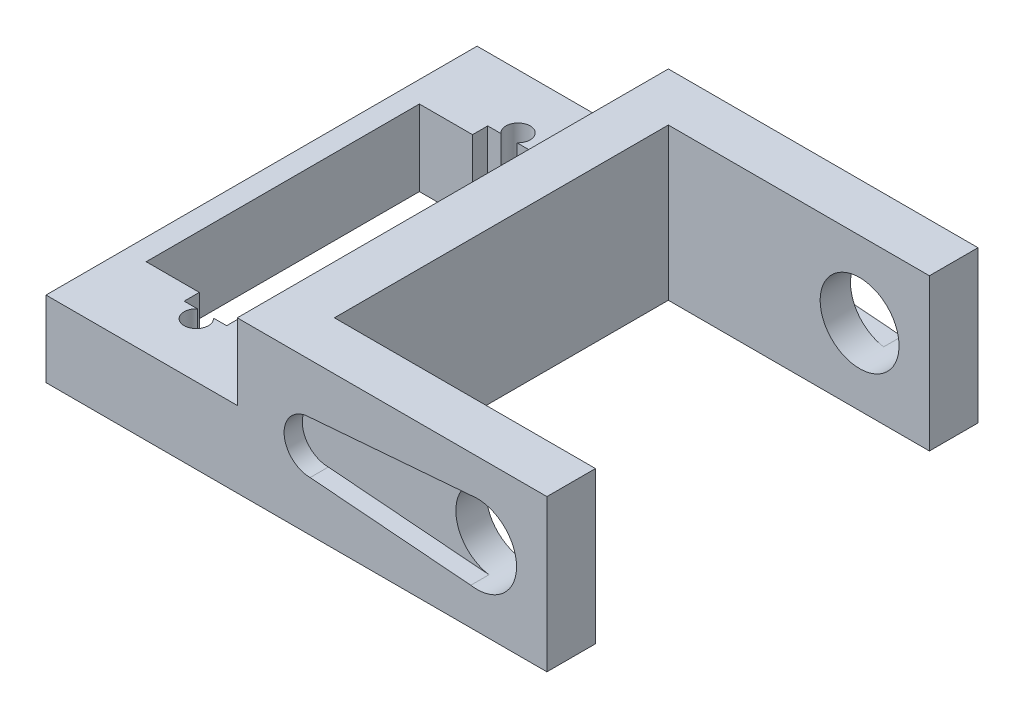
ISO-10303-21;
HEADER;
FILE_DESCRIPTION(('STEP AP214'),'2;1');
FILE_NAME('part.step','',(''),(''),'','','');
FILE_SCHEMA(('AUTOMOTIVE_DESIGN { 1 0 10303 214 1 1 1 1 }'));
ENDSEC;
DATA;
#1=APPLICATION_CONTEXT('core data for automotive mechanical design processes');
#2=APPLICATION_PROTOCOL_DEFINITION('international standard','automotive_design',2000,#1);
#3=PRODUCT_CONTEXT('',#1,'mechanical');
#4=PRODUCT('Part','Part','',(#3));
#5=PRODUCT_RELATED_PRODUCT_CATEGORY('part','',(#4));
#6=PRODUCT_DEFINITION_FORMATION('','',#4);
#7=PRODUCT_DEFINITION_CONTEXT('part definition',#1,'design');
#8=PRODUCT_DEFINITION('design','',#6,#7);
#9=PRODUCT_DEFINITION_SHAPE('','',#8);
#10=(LENGTH_UNIT() NAMED_UNIT(*) SI_UNIT(.MILLI.,.METRE.));
#11=(NAMED_UNIT(*) PLANE_ANGLE_UNIT() SI_UNIT($,.RADIAN.));
#12=(NAMED_UNIT(*) SI_UNIT($,.STERADIAN.) SOLID_ANGLE_UNIT());
#13=UNCERTAINTY_MEASURE_WITH_UNIT(LENGTH_MEASURE(1.E-05),#10,'distance_accuracy_value','');
#14=(GEOMETRIC_REPRESENTATION_CONTEXT(3) GLOBAL_UNCERTAINTY_ASSIGNED_CONTEXT((#13)) GLOBAL_UNIT_ASSIGNED_CONTEXT((#10,
#11,#12)) REPRESENTATION_CONTEXT('',''));
#15=CARTESIAN_POINT('',(0.,0.,0.));
#16=DIRECTION('',(0.,0.,1.));
#17=DIRECTION('',(1.,0.,0.));
#18=AXIS2_PLACEMENT_3D('',#15,#16,#17);
#19=CARTESIAN_POINT('',(-20.955,12.7,18.034));
#20=DIRECTION('',(0.,0.,-1.));
#21=DIRECTION('',(-1.,0.,0.));
#22=AXIS2_PLACEMENT_3D('',#19,#20,#21);
#23=PLANE('',#22);
#24=DIRECTION('',(1.,0.,0.));
#25=VECTOR('',#24,1.);
#26=CARTESIAN_POINT('',(-20.955,12.7,18.034));
#27=LINE('',#26,#25);
#28=CARTESIAN_POINT('',(-4.953,12.7,18.034));
#29=VERTEX_POINT('',#28);
#30=CARTESIAN_POINT('',(20.955,12.7,18.034));
#31=VERTEX_POINT('',#30);
#32=EDGE_CURVE('E496',#29,#31,#27,.T.);
#33=ORIENTED_EDGE('',*,*,#32,.F.);
#34=DIRECTION('',(0.,1.,0.));
#35=VECTOR('',#34,1.);
#36=CARTESIAN_POINT('',(-4.953,6.35,18.034));
#37=LINE('',#36,#35);
#38=CARTESIAN_POINT('',(-4.953,6.35,18.034));
#39=VERTEX_POINT('',#38);
#40=EDGE_CURVE('E456',#39,#29,#37,.T.);
#41=ORIENTED_EDGE('',*,*,#40,.F.);
#42=DIRECTION('',(1.,0.,0.));
#43=VECTOR('',#42,1.);
#44=CARTESIAN_POINT('',(-20.955,6.35,18.034));
#45=LINE('',#44,#43);
#46=CARTESIAN_POINT('',(-20.955,6.35,18.034));
#47=VERTEX_POINT('',#46);
#48=EDGE_CURVE('E448',#47,#39,#45,.T.);
#49=ORIENTED_EDGE('',*,*,#48,.F.);
#50=DIRECTION('',(0.,-1.,0.));
#51=VECTOR('',#50,1.);
#52=CARTESIAN_POINT('',(-20.955,12.7,18.034));
#53=LINE('',#52,#51);
#54=CARTESIAN_POINT('',(-20.955,0.,18.034));
#55=VERTEX_POINT('',#54);
#56=EDGE_CURVE('E512',#47,#55,#53,.T.);
#57=ORIENTED_EDGE('',*,*,#56,.T.);
#58=DIRECTION('',(1.,0.,0.));
#59=VECTOR('',#58,1.);
#60=CARTESIAN_POINT('',(-20.955,0.,18.034));
#61=LINE('',#60,#59);
#62=CARTESIAN_POINT('',(20.955,0.,18.034));
#63=VERTEX_POINT('',#62);
#64=EDGE_CURVE('E508',#55,#63,#61,.T.);
#65=ORIENTED_EDGE('',*,*,#64,.T.);
#66=DIRECTION('',(0.,-1.,0.));
#67=VECTOR('',#66,1.);
#68=CARTESIAN_POINT('',(20.955,12.7,18.034));
#69=LINE('',#68,#67);
#70=EDGE_CURVE('E498',#31,#63,#69,.T.);
#71=ORIENTED_EDGE('',*,*,#70,.F.);
#72=EDGE_LOOP('',(#33,#41,#49,#57,#65,#71));
#73=FACE_BOUND('',#72,.T.);
#74=DIRECTION('',(0.996775462939374,0.0802413639091295,0.));
#75=VECTOR('',#74,1.);
#76=CARTESIAN_POINT('',(-0.674684556216888,8.38107651837434,18.034));
#77=LINE('',#76,#75);
#78=CARTESIAN_POINT('',(1.14299999999999,8.52740183773693,18.034));
#79=VERTEX_POINT('',#78);
#80=CARTESIAN_POINT('',(14.5847947599705,9.60947898051289,18.034));
#81=VERTEX_POINT('',#80);
#82=EDGE_CURVE('E295',#79,#81,#77,.T.);
#83=ORIENTED_EDGE('',*,*,#82,.T.);
#84=CARTESIAN_POINT('',(15.113,6.35,18.034));
#85=DIRECTION('',(0.,0.,-1.));
#86=DIRECTION('',(-1.,0.,0.));
#87=AXIS2_PLACEMENT_3D('',#84,#85,#86);
#88=CIRCLE('',#87,3.302);
#89=CARTESIAN_POINT('',(14.5847947599705,3.09052101948711,18.034));
#90=VERTEX_POINT('',#89);
#91=EDGE_CURVE('E283',#81,#90,#88,.T.);
#92=ORIENTED_EDGE('',*,*,#91,.T.);
#93=DIRECTION('',(0.996775462939374,-0.0802413639091295,0.));
#94=VECTOR('',#93,1.);
#95=CARTESIAN_POINT('',(0.34109475153221,4.2371522903043,18.034));
#96=LINE('',#95,#94);
#97=CARTESIAN_POINT('',(1.14299999999999,4.17259816226307,18.034));
#98=VERTEX_POINT('',#97);
#99=EDGE_CURVE('E296',#98,#90,#96,.T.);
#100=ORIENTED_EDGE('',*,*,#99,.F.);
#101=CARTESIAN_POINT('',(1.14299999999999,6.35,18.034));
#102=DIRECTION('',(0.,0.,-1.));
#103=DIRECTION('',(-1.,0.,0.));
#104=AXIS2_PLACEMENT_3D('',#101,#102,#103);
#105=CIRCLE('',#104,2.17740183773693);
#106=EDGE_CURVE('E86',#98,#79,#105,.T.);
#107=ORIENTED_EDGE('',*,*,#106,.T.);
#108=EDGE_LOOP('',(#83,#92,#100,#107));
#109=FACE_BOUND('',#108,.T.);
#110=ADVANCED_FACE('F63',(#73,#109),#23,.F.);
#111=CARTESIAN_POINT('',(0.,0.,0.));
#112=DIRECTION('',(0.,1.,0.));
#113=DIRECTION('',(0.,0.,1.));
#114=AXIS2_PLACEMENT_3D('',#111,#112,#113);
#115=PLANE('',#114);
#116=DIRECTION('',(0.,0.,1.));
#117=VECTOR('',#116,1.);
#118=CARTESIAN_POINT('',(-0.888999999999997,0.,-13.97));
#119=LINE('',#118,#117);
#120=CARTESIAN_POINT('',(-0.888999999999997,0.,-13.97));
#121=VERTEX_POINT('',#120);
#122=CARTESIAN_POINT('',(-0.888999999999994,0.,13.97));
#123=VERTEX_POINT('',#122);
#124=EDGE_CURVE('E466',#121,#123,#119,.T.);
#125=ORIENTED_EDGE('',*,*,#124,.T.);
#126=DIRECTION('',(1.,0.,0.));
#127=VECTOR('',#126,1.);
#128=CARTESIAN_POINT('',(20.955,0.,13.97));
#129=LINE('',#128,#127);
#130=CARTESIAN_POINT('',(20.955,0.,13.97));
#131=VERTEX_POINT('',#130);
#132=EDGE_CURVE('E470',#123,#131,#129,.T.);
#133=ORIENTED_EDGE('',*,*,#132,.T.);
#134=DIRECTION('',(0.,0.,-1.));
#135=VECTOR('',#134,1.);
#136=CARTESIAN_POINT('',(20.955,0.,-18.034));
#137=LINE('',#136,#135);
#138=EDGE_CURVE('E499',#63,#131,#137,.T.);
#139=ORIENTED_EDGE('',*,*,#138,.F.);
#140=ORIENTED_EDGE('',*,*,#64,.F.);
#141=DIRECTION('',(0.,0.,1.));
#142=VECTOR('',#141,1.);
#143=CARTESIAN_POINT('',(-20.955,0.,-18.034));
#144=LINE('',#143,#142);
#145=CARTESIAN_POINT('',(-20.955,0.,-18.034));
#146=VERTEX_POINT('',#145);
#147=EDGE_CURVE('E505',#146,#55,#144,.T.);
#148=ORIENTED_EDGE('',*,*,#147,.F.);
#149=DIRECTION('',(-1.,0.,0.));
#150=VECTOR('',#149,1.);
#151=CARTESIAN_POINT('',(-20.955,0.,-18.034));
#152=LINE('',#151,#150);
#153=CARTESIAN_POINT('',(20.955,0.,-18.034));
#154=VERTEX_POINT('',#153);
#155=EDGE_CURVE('E502',#154,#146,#152,.T.);
#156=ORIENTED_EDGE('',*,*,#155,.F.);
#157=CARTESIAN_POINT('',(20.955,0.,-13.97));
#158=VERTEX_POINT('',#157);
#159=EDGE_CURVE('E483',#158,#154,#137,.T.);
#160=ORIENTED_EDGE('',*,*,#159,.F.);
#161=DIRECTION('',(-1.,0.,0.));
#162=VECTOR('',#161,1.);
#163=CARTESIAN_POINT('',(20.955,0.,-13.97));
#164=LINE('',#163,#162);
#165=EDGE_CURVE('E463',#158,#121,#164,.T.);
#166=ORIENTED_EDGE('',*,*,#165,.T.);
#167=EDGE_LOOP('',(#125,#133,#139,#140,#148,#156,#160,#166));
#168=FACE_BOUND('',#167,.T.);
#169=DIRECTION('',(0.,0.,-1.));
#170=VECTOR('',#169,1.);
#171=CARTESIAN_POINT('',(-14.732,0.,-10.16));
#172=LINE('',#171,#170);
#173=CARTESIAN_POINT('',(-14.732,0.,-11.43));
#174=VERTEX_POINT('',#173);
#175=CARTESIAN_POINT('',(-14.732,0.,-12.7));
#176=VERTEX_POINT('',#175);
#177=EDGE_CURVE('E356',#174,#176,#172,.T.);
#178=ORIENTED_EDGE('',*,*,#177,.F.);
#179=DIRECTION('',(-1.,0.,0.));
#180=VECTOR('',#179,1.);
#181=CARTESIAN_POINT('',(-6.731,0.,-11.43));
#182=LINE('',#181,#180);
#183=CARTESIAN_POINT('',(-19.177,0.,-11.43));
#184=VERTEX_POINT('',#183);
#185=EDGE_CURVE('E419',#174,#184,#182,.T.);
#186=ORIENTED_EDGE('',*,*,#185,.T.);
#187=DIRECTION('',(0.,0.,1.));
#188=VECTOR('',#187,1.);
#189=CARTESIAN_POINT('',(-19.177,0.,-11.43));
#190=LINE('',#189,#188);
#191=CARTESIAN_POINT('',(-19.177,0.,11.43));
#192=VERTEX_POINT('',#191);
#193=EDGE_CURVE('E408',#184,#192,#190,.T.);
#194=ORIENTED_EDGE('',*,*,#193,.T.);
#195=DIRECTION('',(1.,0.,0.));
#196=VECTOR('',#195,1.);
#197=CARTESIAN_POINT('',(-6.731,0.,11.43));
#198=LINE('',#197,#196);
#199=CARTESIAN_POINT('',(-14.732,0.,11.43));
#200=VERTEX_POINT('',#199);
#201=EDGE_CURVE('E413',#192,#200,#198,.T.);
#202=ORIENTED_EDGE('',*,*,#201,.T.);
#203=DIRECTION('',(0.,0.,1.));
#204=VECTOR('',#203,1.);
#205=CARTESIAN_POINT('',(-14.732,0.,10.16));
#206=LINE('',#205,#204);
#207=CARTESIAN_POINT('',(-14.732,0.,12.7));
#208=VERTEX_POINT('',#207);
#209=EDGE_CURVE('E375',#200,#208,#206,.T.);
#210=ORIENTED_EDGE('',*,*,#209,.T.);
#211=DIRECTION('',(-1.,0.,0.));
#212=VECTOR('',#211,1.);
#213=CARTESIAN_POINT('',(-11.176,0.,12.7));
#214=LINE('',#213,#212);
#215=CARTESIAN_POINT('',(-13.6260208330104,0.,12.7));
#216=VERTEX_POINT('',#215);
#217=EDGE_CURVE('E378',#216,#208,#214,.T.);
#218=ORIENTED_EDGE('',*,*,#217,.F.);
#219=CARTESIAN_POINT('',(-12.954,0.,13.462));
#220=DIRECTION('',(0.,1.,0.));
#221=DIRECTION('',(0.,0.,1.));
#222=AXIS2_PLACEMENT_3D('',#219,#220,#221);
#223=CIRCLE('',#222,1.016);
#224=CARTESIAN_POINT('',(-12.2819791669896,0.,12.7));
#225=VERTEX_POINT('',#224);
#226=EDGE_CURVE('E389',#216,#225,#223,.T.);
#227=ORIENTED_EDGE('',*,*,#226,.T.);
#228=CARTESIAN_POINT('',(-11.176,0.,12.7));
#229=VERTEX_POINT('',#228);
#230=EDGE_CURVE('E380',#229,#225,#214,.T.);
#231=ORIENTED_EDGE('',*,*,#230,.F.);
#232=DIRECTION('',(0.,0.,1.));
#233=VECTOR('',#232,1.);
#234=CARTESIAN_POINT('',(-11.176,0.,10.16));
#235=LINE('',#234,#233);
#236=CARTESIAN_POINT('',(-11.176,0.,11.43));
#237=VERTEX_POINT('',#236);
#238=EDGE_CURVE('E383',#237,#229,#235,.T.);
#239=ORIENTED_EDGE('',*,*,#238,.F.);
#240=CARTESIAN_POINT('',(-6.731,0.,11.43));
#241=VERTEX_POINT('',#240);
#242=EDGE_CURVE('E411',#237,#241,#198,.T.);
#243=ORIENTED_EDGE('',*,*,#242,.T.);
#244=DIRECTION('',(0.,0.,-1.));
#245=VECTOR('',#244,1.);
#246=CARTESIAN_POINT('',(-6.731,0.,-11.43));
#247=LINE('',#246,#245);
#248=CARTESIAN_POINT('',(-6.731,0.,-11.43));
#249=VERTEX_POINT('',#248);
#250=EDGE_CURVE('E416',#241,#249,#247,.T.);
#251=ORIENTED_EDGE('',*,*,#250,.T.);
#252=CARTESIAN_POINT('',(-11.176,0.,-11.43));
#253=VERTEX_POINT('',#252);
#254=EDGE_CURVE('E420',#249,#253,#182,.T.);
#255=ORIENTED_EDGE('',*,*,#254,.T.);
#256=DIRECTION('',(0.,0.,-1.));
#257=VECTOR('',#256,1.);
#258=CARTESIAN_POINT('',(-11.176,0.,-10.16));
#259=LINE('',#258,#257);
#260=CARTESIAN_POINT('',(-11.176,0.,-12.7));
#261=VERTEX_POINT('',#260);
#262=EDGE_CURVE('E352',#253,#261,#259,.T.);
#263=ORIENTED_EDGE('',*,*,#262,.T.);
#264=DIRECTION('',(-1.,0.,0.));
#265=VECTOR('',#264,1.);
#266=CARTESIAN_POINT('',(-11.176,0.,-12.7));
#267=LINE('',#266,#265);
#268=CARTESIAN_POINT('',(-12.2819791669896,0.,-12.7));
#269=VERTEX_POINT('',#268);
#270=EDGE_CURVE('E366',#261,#269,#267,.T.);
#271=ORIENTED_EDGE('',*,*,#270,.T.);
#272=CARTESIAN_POINT('',(-12.954,0.,-13.462));
#273=DIRECTION('',(0.,-1.,0.));
#274=DIRECTION('',(0.,0.,-1.));
#275=AXIS2_PLACEMENT_3D('',#272,#273,#274);
#276=CIRCLE('',#275,1.016);
#277=CARTESIAN_POINT('',(-13.6260208330104,0.,-12.7));
#278=VERTEX_POINT('',#277);
#279=EDGE_CURVE('E344',#278,#269,#276,.T.);
#280=ORIENTED_EDGE('',*,*,#279,.F.);
#281=EDGE_CURVE('E369',#278,#176,#267,.T.);
#282=ORIENTED_EDGE('',*,*,#281,.T.);
#283=EDGE_LOOP('',(#178,#186,#194,#202,#210,#218,#227,#231,#239,#243,#251,#255,#263,#271,#280,#282));
#284=FACE_BOUND('',#283,.T.);
#285=ADVANCED_FACE('F534',(#168,#284),#115,.F.);
#286=CARTESIAN_POINT('',(0.,6.35,0.));
#287=DIRECTION('',(0.,-1.,0.));
#288=DIRECTION('',(0.,0.,-1.));
#289=AXIS2_PLACEMENT_3D('',#286,#287,#288);
#290=PLANE('',#289);
#291=DIRECTION('',(0.,0.,1.));
#292=VECTOR('',#291,1.);
#293=CARTESIAN_POINT('',(-20.955,6.35,18.034));
#294=LINE('',#293,#292);
#295=CARTESIAN_POINT('',(-20.955,6.35,-18.034));
#296=VERTEX_POINT('',#295);
#297=EDGE_CURVE('E446',#296,#47,#294,.T.);
#298=ORIENTED_EDGE('',*,*,#297,.T.);
#299=ORIENTED_EDGE('',*,*,#48,.T.);
#300=DIRECTION('',(0.,0.,-1.));
#301=VECTOR('',#300,1.);
#302=CARTESIAN_POINT('',(-4.953,6.35,18.034));
#303=LINE('',#302,#301);
#304=CARTESIAN_POINT('',(-4.953,6.35,-18.034));
#305=VERTEX_POINT('',#304);
#306=EDGE_CURVE('E451',#39,#305,#303,.T.);
#307=ORIENTED_EDGE('',*,*,#306,.T.);
#308=DIRECTION('',(-1.,0.,0.));
#309=VECTOR('',#308,1.);
#310=CARTESIAN_POINT('',(-20.955,6.35,-18.034));
#311=LINE('',#310,#309);
#312=EDGE_CURVE('E454',#305,#296,#311,.T.);
#313=ORIENTED_EDGE('',*,*,#312,.T.);
#314=EDGE_LOOP('',(#298,#299,#307,#313));
#315=FACE_BOUND('',#314,.T.);
#316=DIRECTION('',(0.,0.,-1.));
#317=VECTOR('',#316,1.);
#318=CARTESIAN_POINT('',(-14.732,6.35,-10.16));
#319=LINE('',#318,#317);
#320=CARTESIAN_POINT('',(-14.732,6.35,-11.43));
#321=VERTEX_POINT('',#320);
#322=CARTESIAN_POINT('',(-14.732,6.35,-12.7));
#323=VERTEX_POINT('',#322);
#324=EDGE_CURVE('E360',#321,#323,#319,.T.);
#325=ORIENTED_EDGE('',*,*,#324,.T.);
#326=DIRECTION('',(-1.,0.,0.));
#327=VECTOR('',#326,1.);
#328=CARTESIAN_POINT('',(-11.176,6.35,-12.7));
#329=LINE('',#328,#327);
#330=CARTESIAN_POINT('',(-13.6260208330104,6.35,-12.7));
#331=VERTEX_POINT('',#330);
#332=EDGE_CURVE('E359',#331,#323,#329,.T.);
#333=ORIENTED_EDGE('',*,*,#332,.F.);
#334=CARTESIAN_POINT('',(-12.954,6.35,-13.462));
#335=DIRECTION('',(0.,-1.,0.));
#336=DIRECTION('',(0.,0.,-1.));
#337=AXIS2_PLACEMENT_3D('',#334,#335,#336);
#338=CIRCLE('',#337,1.016);
#339=CARTESIAN_POINT('',(-12.2819791669896,6.35,-12.7));
#340=VERTEX_POINT('',#339);
#341=EDGE_CURVE('E349',#331,#340,#338,.T.);
#342=ORIENTED_EDGE('',*,*,#341,.T.);
#343=CARTESIAN_POINT('',(-11.176,6.35,-12.7));
#344=VERTEX_POINT('',#343);
#345=EDGE_CURVE('E355',#344,#340,#329,.T.);
#346=ORIENTED_EDGE('',*,*,#345,.F.);
#347=DIRECTION('',(0.,0.,-1.));
#348=VECTOR('',#347,1.);
#349=CARTESIAN_POINT('',(-11.176,6.35,-10.16));
#350=LINE('',#349,#348);
#351=CARTESIAN_POINT('',(-11.176,6.35,-11.43));
#352=VERTEX_POINT('',#351);
#353=EDGE_CURVE('E353',#352,#344,#350,.T.);
#354=ORIENTED_EDGE('',*,*,#353,.F.);
#355=DIRECTION('',(-1.,0.,0.));
#356=VECTOR('',#355,1.);
#357=CARTESIAN_POINT('',(-6.731,6.35,-11.43));
#358=LINE('',#357,#356);
#359=CARTESIAN_POINT('',(-6.731,6.35,-11.43));
#360=VERTEX_POINT('',#359);
#361=EDGE_CURVE('E412',#360,#352,#358,.T.);
#362=ORIENTED_EDGE('',*,*,#361,.F.);
#363=DIRECTION('',(0.,0.,-1.));
#364=VECTOR('',#363,1.);
#365=CARTESIAN_POINT('',(-6.731,6.35,-11.43));
#366=LINE('',#365,#364);
#367=CARTESIAN_POINT('',(-6.731,6.35,11.43));
#368=VERTEX_POINT('',#367);
#369=EDGE_CURVE('E429',#368,#360,#366,.T.);
#370=ORIENTED_EDGE('',*,*,#369,.F.);
#371=DIRECTION('',(1.,0.,0.));
#372=VECTOR('',#371,1.);
#373=CARTESIAN_POINT('',(-6.731,6.35,11.43));
#374=LINE('',#373,#372);
#375=CARTESIAN_POINT('',(-11.176,6.35,11.43));
#376=VERTEX_POINT('',#375);
#377=EDGE_CURVE('E425',#376,#368,#374,.T.);
#378=ORIENTED_EDGE('',*,*,#377,.F.);
#379=DIRECTION('',(0.,0.,1.));
#380=VECTOR('',#379,1.);
#381=CARTESIAN_POINT('',(-11.176,6.35,10.16));
#382=LINE('',#381,#380);
#383=CARTESIAN_POINT('',(-11.176,6.35,12.7));
#384=VERTEX_POINT('',#383);
#385=EDGE_CURVE('E379',#376,#384,#382,.T.);
#386=ORIENTED_EDGE('',*,*,#385,.T.);
#387=DIRECTION('',(-1.,0.,0.));
#388=VECTOR('',#387,1.);
#389=CARTESIAN_POINT('',(-11.176,6.35,12.7));
#390=LINE('',#389,#388);
#391=CARTESIAN_POINT('',(-12.2819791669896,6.35,12.7));
#392=VERTEX_POINT('',#391);
#393=EDGE_CURVE('E390',#384,#392,#390,.T.);
#394=ORIENTED_EDGE('',*,*,#393,.T.);
#395=CARTESIAN_POINT('',(-12.954,6.35,13.462));
#396=DIRECTION('',(0.,1.,0.));
#397=DIRECTION('',(0.,0.,1.));
#398=AXIS2_PLACEMENT_3D('',#395,#396,#397);
#399=CIRCLE('',#398,1.016);
#400=CARTESIAN_POINT('',(-13.6260208330104,6.35,12.7));
#401=VERTEX_POINT('',#400);
#402=EDGE_CURVE('E363',#401,#392,#399,.T.);
#403=ORIENTED_EDGE('',*,*,#402,.F.);
#404=CARTESIAN_POINT('',(-14.732,6.35,12.7));
#405=VERTEX_POINT('',#404);
#406=EDGE_CURVE('E388',#401,#405,#390,.T.);
#407=ORIENTED_EDGE('',*,*,#406,.T.);
#408=DIRECTION('',(0.,0.,1.));
#409=VECTOR('',#408,1.);
#410=CARTESIAN_POINT('',(-14.732,6.35,10.16));
#411=LINE('',#410,#409);
#412=CARTESIAN_POINT('',(-14.732,6.35,11.43));
#413=VERTEX_POINT('',#412);
#414=EDGE_CURVE('E386',#413,#405,#411,.T.);
#415=ORIENTED_EDGE('',*,*,#414,.F.);
#416=CARTESIAN_POINT('',(-19.177,6.35,11.43));
#417=VERTEX_POINT('',#416);
#418=EDGE_CURVE('E426',#417,#413,#374,.T.);
#419=ORIENTED_EDGE('',*,*,#418,.F.);
#420=DIRECTION('',(0.,0.,1.));
#421=VECTOR('',#420,1.);
#422=CARTESIAN_POINT('',(-19.177,6.35,-11.43));
#423=LINE('',#422,#421);
#424=CARTESIAN_POINT('',(-19.177,6.35,-11.43));
#425=VERTEX_POINT('',#424);
#426=EDGE_CURVE('E407',#425,#417,#423,.T.);
#427=ORIENTED_EDGE('',*,*,#426,.F.);
#428=EDGE_CURVE('E432',#321,#425,#358,.T.);
#429=ORIENTED_EDGE('',*,*,#428,.F.);
#430=EDGE_LOOP('',(#325,#333,#342,#346,#354,#362,#370,#378,#386,#394,#403,#407,#415,#419,#427,#429));
#431=FACE_BOUND('',#430,.T.);
#432=ADVANCED_FACE('F547',(#315,#431),#290,.F.);
#433=CARTESIAN_POINT('',(-6.731,0.,-11.43));
#434=DIRECTION('',(0.,0.,-1.));
#435=DIRECTION('',(-1.,0.,0.));
#436=AXIS2_PLACEMENT_3D('',#433,#434,#435);
#437=PLANE('',#436);
#438=DIRECTION('',(0.,-1.,0.));
#439=VECTOR('',#438,1.);
#440=CARTESIAN_POINT('',(-14.732,0.,-11.43));
#441=LINE('',#440,#439);
#442=EDGE_CURVE('E524',#321,#174,#441,.T.);
#443=ORIENTED_EDGE('',*,*,#442,.F.);
#444=ORIENTED_EDGE('',*,*,#428,.T.);
#445=DIRECTION('',(0.,1.,0.));
#446=VECTOR('',#445,1.);
#447=CARTESIAN_POINT('',(-19.177,0.,-11.43));
#448=LINE('',#447,#446);
#449=EDGE_CURVE('E435',#184,#425,#448,.T.);
#450=ORIENTED_EDGE('',*,*,#449,.F.);
#451=ORIENTED_EDGE('',*,*,#185,.F.);
#452=EDGE_LOOP('',(#443,#444,#450,#451));
#453=FACE_BOUND('',#452,.T.);
#454=ADVANCED_FACE('F571',(#453),#437,.F.);
#455=CARTESIAN_POINT('',(-6.731,0.,11.43));
#456=DIRECTION('',(0.,0.,1.));
#457=DIRECTION('',(1.,0.,0.));
#458=AXIS2_PLACEMENT_3D('',#455,#456,#457);
#459=PLANE('',#458);
#460=DIRECTION('',(0.,-1.,0.));
#461=VECTOR('',#460,1.);
#462=CARTESIAN_POINT('',(-11.176,0.,11.43));
#463=LINE('',#462,#461);
#464=EDGE_CURVE('E519',#376,#237,#463,.T.);
#465=ORIENTED_EDGE('',*,*,#464,.F.);
#466=ORIENTED_EDGE('',*,*,#377,.T.);
#467=DIRECTION('',(0.,1.,0.));
#468=VECTOR('',#467,1.);
#469=CARTESIAN_POINT('',(-6.731,0.,11.43));
#470=LINE('',#469,#468);
#471=EDGE_CURVE('E441',#241,#368,#470,.T.);
#472=ORIENTED_EDGE('',*,*,#471,.F.);
#473=ORIENTED_EDGE('',*,*,#242,.F.);
#474=EDGE_LOOP('',(#465,#466,#472,#473));
#475=FACE_BOUND('',#474,.T.);
#476=ADVANCED_FACE('F544',(#475),#459,.F.);
#477=CARTESIAN_POINT('',(20.955,12.7,-18.034));
#478=DIRECTION('',(-1.,0.,0.));
#479=DIRECTION('',(0.,0.,1.));
#480=AXIS2_PLACEMENT_3D('',#477,#478,#479);
#481=PLANE('',#480);
#482=ORIENTED_EDGE('',*,*,#138,.T.);
#483=DIRECTION('',(0.,1.,0.));
#484=VECTOR('',#483,1.);
#485=CARTESIAN_POINT('',(20.955,0.,13.97));
#486=LINE('',#485,#484);
#487=CARTESIAN_POINT('',(20.955,12.7,13.97));
#488=VERTEX_POINT('',#487);
#489=EDGE_CURVE('E480',#131,#488,#486,.T.);
#490=ORIENTED_EDGE('',*,*,#489,.T.);
#491=DIRECTION('',(0.,0.,-1.));
#492=VECTOR('',#491,1.);
#493=CARTESIAN_POINT('',(20.955,12.7,-18.034));
#494=LINE('',#493,#492);
#495=EDGE_CURVE('E489',#31,#488,#494,.T.);
#496=ORIENTED_EDGE('',*,*,#495,.F.);
#497=ORIENTED_EDGE('',*,*,#70,.T.);
#498=EDGE_LOOP('',(#482,#490,#496,#497));
#499=FACE_BOUND('',#498,.T.);
#500=ADVANCED_FACE('F629',(#499),#481,.F.);
#501=CARTESIAN_POINT('',(20.955,12.7,-13.97));
#502=VERTEX_POINT('',#501);
#503=CARTESIAN_POINT('',(20.955,12.7,-18.034));
#504=VERTEX_POINT('',#503);
#505=EDGE_CURVE('E493',#502,#504,#494,.T.);
#506=ORIENTED_EDGE('',*,*,#505,.F.);
#507=DIRECTION('',(0.,1.,0.));
#508=VECTOR('',#507,1.);
#509=CARTESIAN_POINT('',(20.955,0.,-13.97));
#510=LINE('',#509,#508);
#511=EDGE_CURVE('E473',#158,#502,#510,.T.);
#512=ORIENTED_EDGE('',*,*,#511,.F.);
#513=ORIENTED_EDGE('',*,*,#159,.T.);
#514=DIRECTION('',(0.,-1.,0.));
#515=VECTOR('',#514,1.);
#516=CARTESIAN_POINT('',(20.955,12.7,-18.034));
#517=LINE('',#516,#515);
#518=EDGE_CURVE('E516',#504,#154,#517,.T.);
#519=ORIENTED_EDGE('',*,*,#518,.F.);
#520=EDGE_LOOP('',(#506,#512,#513,#519));
#521=FACE_BOUND('',#520,.T.);
#522=ADVANCED_FACE('F65',(#521),#481,.F.);
#523=CARTESIAN_POINT('',(-20.955,12.7,-18.034));
#524=DIRECTION('',(0.,0.,1.));
#525=DIRECTION('',(1.,0.,0.));
#526=AXIS2_PLACEMENT_3D('',#523,#524,#525);
#527=PLANE('',#526);
#528=CARTESIAN_POINT('',(15.113,6.35,-18.034));
#529=DIRECTION('',(0.,0.,-1.));
#530=DIRECTION('',(-1.,0.,0.));
#531=AXIS2_PLACEMENT_3D('',#528,#529,#530);
#532=CIRCLE('',#531,3.302);
#533=CARTESIAN_POINT('',(14.5847947599705,9.60947898051289,-18.034));
#534=VERTEX_POINT('',#533);
#535=CARTESIAN_POINT('',(14.5847947599705,3.09052101948711,-18.034));
#536=VERTEX_POINT('',#535);
#537=EDGE_CURVE('E332',#534,#536,#532,.T.);
#538=ORIENTED_EDGE('',*,*,#537,.F.);
#539=DIRECTION('',(0.996775462939374,0.0802413639091295,0.));
#540=VECTOR('',#539,1.);
#541=CARTESIAN_POINT('',(-0.674684556216888,8.38107651837434,-18.034));
#542=LINE('',#541,#540);
#543=CARTESIAN_POINT('',(1.14299999999999,8.52740183773693,-18.034));
#544=VERTEX_POINT('',#543);
#545=EDGE_CURVE('E329',#544,#534,#542,.T.);
#546=ORIENTED_EDGE('',*,*,#545,.F.);
#547=CARTESIAN_POINT('',(1.14299999999999,6.35,-18.034));
#548=DIRECTION('',(0.,0.,-1.));
#549=DIRECTION('',(-1.,0.,0.));
#550=AXIS2_PLACEMENT_3D('',#547,#548,#549);
#551=CIRCLE('',#550,2.17740183773693);
#552=CARTESIAN_POINT('',(1.14299999999999,4.17259816226307,-18.034));
#553=VERTEX_POINT('',#552);
#554=EDGE_CURVE('E314',#553,#544,#551,.T.);
#555=ORIENTED_EDGE('',*,*,#554,.F.);
#556=DIRECTION('',(0.996775462939374,-0.0802413639091295,0.));
#557=VECTOR('',#556,1.);
#558=CARTESIAN_POINT('',(0.34109475153221,4.2371522903043,-18.034));
#559=LINE('',#558,#557);
#560=EDGE_CURVE('E321',#553,#536,#559,.T.);
#561=ORIENTED_EDGE('',*,*,#560,.T.);
#562=EDGE_LOOP('',(#538,#546,#555,#561));
#563=FACE_BOUND('',#562,.T.);
#564=ORIENTED_EDGE('',*,*,#312,.F.);
#565=DIRECTION('',(0.,1.,0.));
#566=VECTOR('',#565,1.);
#567=CARTESIAN_POINT('',(-4.953,6.35,-18.034));
#568=LINE('',#567,#566);
#569=CARTESIAN_POINT('',(-4.953,12.7,-18.034));
#570=VERTEX_POINT('',#569);
#571=EDGE_CURVE('E458',#305,#570,#568,.T.);
#572=ORIENTED_EDGE('',*,*,#571,.T.);
#573=DIRECTION('',(-1.,0.,0.));
#574=VECTOR('',#573,1.);
#575=CARTESIAN_POINT('',(-20.955,12.7,-18.034));
#576=LINE('',#575,#574);
#577=EDGE_CURVE('E492',#504,#570,#576,.T.);
#578=ORIENTED_EDGE('',*,*,#577,.F.);
#579=ORIENTED_EDGE('',*,*,#518,.T.);
#580=ORIENTED_EDGE('',*,*,#155,.T.);
#581=DIRECTION('',(0.,-1.,0.));
#582=VECTOR('',#581,1.);
#583=CARTESIAN_POINT('',(-20.955,12.7,-18.034));
#584=LINE('',#583,#582);
#585=EDGE_CURVE('E514',#296,#146,#584,.T.);
#586=ORIENTED_EDGE('',*,*,#585,.F.);
#587=EDGE_LOOP('',(#564,#572,#578,#579,#580,#586));
#588=FACE_BOUND('',#587,.T.);
#589=ADVANCED_FACE('F622',(#563,#588),#527,.F.);
#590=CARTESIAN_POINT('',(-20.955,12.7,-18.034));
#591=DIRECTION('',(1.,0.,0.));
#592=DIRECTION('',(0.,0.,-1.));
#593=AXIS2_PLACEMENT_3D('',#590,#591,#592);
#594=PLANE('',#593);
#595=ORIENTED_EDGE('',*,*,#56,.F.);
#596=ORIENTED_EDGE('',*,*,#297,.F.);
#597=ORIENTED_EDGE('',*,*,#585,.T.);
#598=ORIENTED_EDGE('',*,*,#147,.T.);
#599=EDGE_LOOP('',(#595,#596,#597,#598));
#600=FACE_BOUND('',#599,.T.);
#601=ADVANCED_FACE('F619',(#600),#594,.F.);
#602=CARTESIAN_POINT('',(0.,12.7,0.));
#603=DIRECTION('',(0.,1.,0.));
#604=DIRECTION('',(0.,0.,1.));
#605=AXIS2_PLACEMENT_3D('',#602,#603,#604);
#606=PLANE('',#605);
#607=DIRECTION('',(0.,0.,-1.));
#608=VECTOR('',#607,1.);
#609=CARTESIAN_POINT('',(-4.953,12.7,18.034));
#610=LINE('',#609,#608);
#611=EDGE_CURVE('E438',#29,#570,#610,.T.);
#612=ORIENTED_EDGE('',*,*,#611,.F.);
#613=ORIENTED_EDGE('',*,*,#32,.T.);
#614=ORIENTED_EDGE('',*,*,#495,.T.);
#615=DIRECTION('',(1.,0.,0.));
#616=VECTOR('',#615,1.);
#617=CARTESIAN_POINT('',(20.955,12.7,13.97));
#618=LINE('',#617,#616);
#619=CARTESIAN_POINT('',(-0.888999999999994,12.7,13.97));
#620=VERTEX_POINT('',#619);
#621=EDGE_CURVE('E467',#620,#488,#618,.T.);
#622=ORIENTED_EDGE('',*,*,#621,.F.);
#623=DIRECTION('',(0.,0.,1.));
#624=VECTOR('',#623,1.);
#625=CARTESIAN_POINT('',(-0.888999999999997,12.7,-13.97));
#626=LINE('',#625,#624);
#627=CARTESIAN_POINT('',(-0.888999999999997,12.7,-13.97));
#628=VERTEX_POINT('',#627);
#629=EDGE_CURVE('E476',#628,#620,#626,.T.);
#630=ORIENTED_EDGE('',*,*,#629,.F.);
#631=DIRECTION('',(-1.,0.,0.));
#632=VECTOR('',#631,1.);
#633=CARTESIAN_POINT('',(20.955,12.7,-13.97));
#634=LINE('',#633,#632);
#635=EDGE_CURVE('E461',#502,#628,#634,.T.);
#636=ORIENTED_EDGE('',*,*,#635,.F.);
#637=ORIENTED_EDGE('',*,*,#505,.T.);
#638=ORIENTED_EDGE('',*,*,#577,.T.);
#639=EDGE_LOOP('',(#612,#613,#614,#622,#630,#636,#637,#638));
#640=FACE_BOUND('',#639,.T.);
#641=ADVANCED_FACE('F621',(#640),#606,.T.);
#642=CARTESIAN_POINT('',(20.955,0.,13.97));
#643=DIRECTION('',(0.,0.,1.));
#644=DIRECTION('',(1.,0.,0.));
#645=AXIS2_PLACEMENT_3D('',#642,#643,#644);
#646=PLANE('',#645);
#647=CARTESIAN_POINT('',(15.113,6.35,13.97));
#648=DIRECTION('',(0.,0.,1.));
#649=DIRECTION('',(1.,0.,0.));
#650=AXIS2_PLACEMENT_3D('',#647,#648,#649);
#651=CIRCLE('',#650,3.302);
#652=CARTESIAN_POINT('',(18.415,6.35,13.97));
#653=VERTEX_POINT('',#652);
#654=EDGE_CURVE('E991',#653,#653,#651,.T.);
#655=ORIENTED_EDGE('',*,*,#654,.T.);
#656=EDGE_LOOP('',(#655));
#657=FACE_BOUND('',#656,.T.);
#658=ORIENTED_EDGE('',*,*,#621,.T.);
#659=ORIENTED_EDGE('',*,*,#489,.F.);
#660=ORIENTED_EDGE('',*,*,#132,.F.);
#661=DIRECTION('',(0.,1.,0.));
#662=VECTOR('',#661,1.);
#663=CARTESIAN_POINT('',(-0.888999999999994,0.,13.97));
#664=LINE('',#663,#662);
#665=EDGE_CURVE('E484',#123,#620,#664,.T.);
#666=ORIENTED_EDGE('',*,*,#665,.T.);
#667=EDGE_LOOP('',(#658,#659,#660,#666));
#668=FACE_BOUND('',#667,.T.);
#669=ADVANCED_FACE('F662',(#657,#668),#646,.F.);
#670=CARTESIAN_POINT('',(-0.888999999999997,0.,-13.97));
#671=DIRECTION('',(-1.,0.,0.));
#672=DIRECTION('',(0.,0.,1.));
#673=AXIS2_PLACEMENT_3D('',#670,#671,#672);
#674=PLANE('',#673);
#675=ORIENTED_EDGE('',*,*,#629,.T.);
#676=ORIENTED_EDGE('',*,*,#665,.F.);
#677=ORIENTED_EDGE('',*,*,#124,.F.);
#678=DIRECTION('',(0.,1.,0.));
#679=VECTOR('',#678,1.);
#680=CARTESIAN_POINT('',(-0.888999999999997,0.,-13.97));
#681=LINE('',#680,#679);
#682=EDGE_CURVE('E486',#121,#628,#681,.T.);
#683=ORIENTED_EDGE('',*,*,#682,.T.);
#684=EDGE_LOOP('',(#675,#676,#677,#683));
#685=FACE_BOUND('',#684,.T.);
#686=ADVANCED_FACE('F664',(#685),#674,.F.);
#687=CARTESIAN_POINT('',(20.955,0.,-13.97));
#688=DIRECTION('',(0.,0.,-1.));
#689=DIRECTION('',(-1.,0.,0.));
#690=AXIS2_PLACEMENT_3D('',#687,#688,#689);
#691=PLANE('',#690);
#692=CARTESIAN_POINT('',(15.113,6.35,-13.97));
#693=DIRECTION('',(0.,0.,-1.));
#694=DIRECTION('',(-1.,0.,0.));
#695=AXIS2_PLACEMENT_3D('',#692,#693,#694);
#696=CIRCLE('',#695,3.302);
#697=CARTESIAN_POINT('',(11.811,6.35,-13.97));
#698=VERTEX_POINT('',#697);
#699=EDGE_CURVE('E989',#698,#698,#696,.T.);
#700=ORIENTED_EDGE('',*,*,#699,.T.);
#701=EDGE_LOOP('',(#700));
#702=FACE_BOUND('',#701,.T.);
#703=ORIENTED_EDGE('',*,*,#635,.T.);
#704=ORIENTED_EDGE('',*,*,#682,.F.);
#705=ORIENTED_EDGE('',*,*,#165,.F.);
#706=ORIENTED_EDGE('',*,*,#511,.T.);
#707=EDGE_LOOP('',(#703,#704,#705,#706));
#708=FACE_BOUND('',#707,.T.);
#709=ADVANCED_FACE('F667',(#702,#708),#691,.F.);
#710=CARTESIAN_POINT('',(-4.953,6.35,18.034));
#711=DIRECTION('',(1.,0.,0.));
#712=DIRECTION('',(0.,0.,-1.));
#713=AXIS2_PLACEMENT_3D('',#710,#711,#712);
#714=PLANE('',#713);
#715=ORIENTED_EDGE('',*,*,#611,.T.);
#716=ORIENTED_EDGE('',*,*,#571,.F.);
#717=ORIENTED_EDGE('',*,*,#306,.F.);
#718=ORIENTED_EDGE('',*,*,#40,.T.);
#719=EDGE_LOOP('',(#715,#716,#717,#718));
#720=FACE_BOUND('',#719,.T.);
#721=ADVANCED_FACE('F647',(#720),#714,.F.);
#722=CARTESIAN_POINT('',(-19.177,0.,-11.43));
#723=DIRECTION('',(-1.,0.,0.));
#724=DIRECTION('',(0.,0.,1.));
#725=AXIS2_PLACEMENT_3D('',#722,#723,#724);
#726=PLANE('',#725);
#727=ORIENTED_EDGE('',*,*,#426,.T.);
#728=DIRECTION('',(0.,1.,0.));
#729=VECTOR('',#728,1.);
#730=CARTESIAN_POINT('',(-19.177,0.,11.43));
#731=LINE('',#730,#729);
#732=EDGE_CURVE('E423',#192,#417,#731,.T.);
#733=ORIENTED_EDGE('',*,*,#732,.F.);
#734=ORIENTED_EDGE('',*,*,#193,.F.);
#735=ORIENTED_EDGE('',*,*,#449,.T.);
#736=EDGE_LOOP('',(#727,#733,#734,#735));
#737=FACE_BOUND('',#736,.T.);
#738=ADVANCED_FACE('F575',(#737),#726,.F.);
#739=ORIENTED_EDGE('',*,*,#361,.T.);
#740=DIRECTION('',(0.,-1.,0.));
#741=VECTOR('',#740,1.);
#742=CARTESIAN_POINT('',(-11.176,0.,-11.43));
#743=LINE('',#742,#741);
#744=EDGE_CURVE('E71',#352,#253,#743,.T.);
#745=ORIENTED_EDGE('',*,*,#744,.T.);
#746=ORIENTED_EDGE('',*,*,#254,.F.);
#747=DIRECTION('',(0.,1.,0.));
#748=VECTOR('',#747,1.);
#749=CARTESIAN_POINT('',(-6.731,0.,-11.43));
#750=LINE('',#749,#748);
#751=EDGE_CURVE('E439',#249,#360,#750,.T.);
#752=ORIENTED_EDGE('',*,*,#751,.T.);
#753=EDGE_LOOP('',(#739,#745,#746,#752));
#754=FACE_BOUND('',#753,.T.);
#755=ADVANCED_FACE('F528',(#754),#437,.F.);
#756=CARTESIAN_POINT('',(-6.731,0.,-11.43));
#757=DIRECTION('',(1.,0.,0.));
#758=DIRECTION('',(0.,0.,-1.));
#759=AXIS2_PLACEMENT_3D('',#756,#757,#758);
#760=PLANE('',#759);
#761=ORIENTED_EDGE('',*,*,#369,.T.);
#762=ORIENTED_EDGE('',*,*,#751,.F.);
#763=ORIENTED_EDGE('',*,*,#250,.F.);
#764=ORIENTED_EDGE('',*,*,#471,.T.);
#765=EDGE_LOOP('',(#761,#762,#763,#764));
#766=FACE_BOUND('',#765,.T.);
#767=ADVANCED_FACE('F540',(#766),#760,.F.);
#768=ORIENTED_EDGE('',*,*,#418,.T.);
#769=DIRECTION('',(0.,-1.,0.));
#770=VECTOR('',#769,1.);
#771=CARTESIAN_POINT('',(-14.732,0.,11.43));
#772=LINE('',#771,#770);
#773=EDGE_CURVE('E521',#413,#200,#772,.T.);
#774=ORIENTED_EDGE('',*,*,#773,.T.);
#775=ORIENTED_EDGE('',*,*,#201,.F.);
#776=ORIENTED_EDGE('',*,*,#732,.T.);
#777=EDGE_LOOP('',(#768,#774,#775,#776));
#778=FACE_BOUND('',#777,.T.);
#779=ADVANCED_FACE('F579',(#778),#459,.F.);
#780=CARTESIAN_POINT('',(-14.732,0.,10.16));
#781=DIRECTION('',(-1.,0.,0.));
#782=DIRECTION('',(0.,0.,1.));
#783=AXIS2_PLACEMENT_3D('',#780,#781,#782);
#784=PLANE('',#783);
#785=ORIENTED_EDGE('',*,*,#414,.T.);
#786=DIRECTION('',(0.,1.,0.));
#787=VECTOR('',#786,1.);
#788=CARTESIAN_POINT('',(-14.732,0.,12.7));
#789=LINE('',#788,#787);
#790=EDGE_CURVE('E385',#208,#405,#789,.T.);
#791=ORIENTED_EDGE('',*,*,#790,.F.);
#792=ORIENTED_EDGE('',*,*,#209,.F.);
#793=ORIENTED_EDGE('',*,*,#773,.F.);
#794=EDGE_LOOP('',(#785,#791,#792,#793));
#795=FACE_BOUND('',#794,.T.);
#796=ADVANCED_FACE('F582',(#795),#784,.F.);
#797=CARTESIAN_POINT('',(-11.176,0.,10.16));
#798=DIRECTION('',(-1.,0.,0.));
#799=DIRECTION('',(0.,0.,1.));
#800=AXIS2_PLACEMENT_3D('',#797,#798,#799);
#801=PLANE('',#800);
#802=ORIENTED_EDGE('',*,*,#464,.T.);
#803=ORIENTED_EDGE('',*,*,#238,.T.);
#804=DIRECTION('',(0.,1.,0.));
#805=VECTOR('',#804,1.);
#806=CARTESIAN_POINT('',(-11.176,0.,12.7));
#807=LINE('',#806,#805);
#808=EDGE_CURVE('E395',#229,#384,#807,.T.);
#809=ORIENTED_EDGE('',*,*,#808,.T.);
#810=ORIENTED_EDGE('',*,*,#385,.F.);
#811=EDGE_LOOP('',(#802,#803,#809,#810));
#812=FACE_BOUND('',#811,.T.);
#813=ADVANCED_FACE('F598',(#812),#801,.T.);
#814=CARTESIAN_POINT('',(-11.176,0.,12.7));
#815=DIRECTION('',(0.,0.,-1.));
#816=DIRECTION('',(-1.,0.,0.));
#817=AXIS2_PLACEMENT_3D('',#814,#815,#816);
#818=PLANE('',#817);
#819=ORIENTED_EDGE('',*,*,#217,.T.);
#820=ORIENTED_EDGE('',*,*,#790,.T.);
#821=ORIENTED_EDGE('',*,*,#406,.F.);
#822=DIRECTION('',(0.,1.,0.));
#823=VECTOR('',#822,1.);
#824=CARTESIAN_POINT('',(-13.6260208330104,0.,12.7));
#825=LINE('',#824,#823);
#826=EDGE_CURVE('E405',#216,#401,#825,.T.);
#827=ORIENTED_EDGE('',*,*,#826,.F.);
#828=EDGE_LOOP('',(#819,#820,#821,#827));
#829=FACE_BOUND('',#828,.T.);
#830=ADVANCED_FACE('F588',(#829),#818,.T.);
#831=ORIENTED_EDGE('',*,*,#393,.F.);
#832=ORIENTED_EDGE('',*,*,#808,.F.);
#833=ORIENTED_EDGE('',*,*,#230,.T.);
#834=DIRECTION('',(0.,1.,0.));
#835=VECTOR('',#834,1.);
#836=CARTESIAN_POINT('',(-12.2819791669896,0.,12.7));
#837=LINE('',#836,#835);
#838=EDGE_CURVE('E397',#392,#225,#837,.F.);
#839=ORIENTED_EDGE('',*,*,#838,.F.);
#840=EDGE_LOOP('',(#831,#832,#833,#839));
#841=FACE_BOUND('',#840,.T.);
#842=ADVANCED_FACE('F596',(#841),#818,.T.);
#843=CARTESIAN_POINT('',(-12.954,0.,13.462));
#844=DIRECTION('',(0.,1.,0.));
#845=DIRECTION('',(0.,0.,1.));
#846=AXIS2_PLACEMENT_3D('',#843,#844,#845);
#847=CYLINDRICAL_SURFACE('',#846,1.016);
#848=ORIENTED_EDGE('',*,*,#826,.T.);
#849=ORIENTED_EDGE('',*,*,#402,.T.);
#850=ORIENTED_EDGE('',*,*,#838,.T.);
#851=ORIENTED_EDGE('',*,*,#226,.F.);
#852=EDGE_LOOP('',(#848,#849,#850,#851));
#853=FACE_BOUND('',#852,.T.);
#854=ADVANCED_FACE('F592',(#853),#847,.F.);
#855=CARTESIAN_POINT('',(-11.176,0.,-10.16));
#856=DIRECTION('',(1.,0.,0.));
#857=DIRECTION('',(0.,0.,-1.));
#858=AXIS2_PLACEMENT_3D('',#855,#856,#857);
#859=PLANE('',#858);
#860=ORIENTED_EDGE('',*,*,#353,.T.);
#861=DIRECTION('',(0.,1.,0.));
#862=VECTOR('',#861,1.);
#863=CARTESIAN_POINT('',(-11.176,0.,-12.7));
#864=LINE('',#863,#862);
#865=EDGE_CURVE('E348',#261,#344,#864,.T.);
#866=ORIENTED_EDGE('',*,*,#865,.F.);
#867=ORIENTED_EDGE('',*,*,#262,.F.);
#868=ORIENTED_EDGE('',*,*,#744,.F.);
#869=EDGE_LOOP('',(#860,#866,#867,#868));
#870=FACE_BOUND('',#869,.T.);
#871=ADVANCED_FACE('F549',(#870),#859,.F.);
#872=CARTESIAN_POINT('',(-14.732,0.,-10.16));
#873=DIRECTION('',(1.,0.,0.));
#874=DIRECTION('',(0.,0.,-1.));
#875=AXIS2_PLACEMENT_3D('',#872,#873,#874);
#876=PLANE('',#875);
#877=ORIENTED_EDGE('',*,*,#442,.T.);
#878=ORIENTED_EDGE('',*,*,#177,.T.);
#879=DIRECTION('',(0.,1.,0.));
#880=VECTOR('',#879,1.);
#881=CARTESIAN_POINT('',(-14.732,0.,-12.7));
#882=LINE('',#881,#880);
#883=EDGE_CURVE('E345',#176,#323,#882,.T.);
#884=ORIENTED_EDGE('',*,*,#883,.T.);
#885=ORIENTED_EDGE('',*,*,#324,.F.);
#886=EDGE_LOOP('',(#877,#878,#884,#885));
#887=FACE_BOUND('',#886,.T.);
#888=ADVANCED_FACE('F564',(#887),#876,.T.);
#889=CARTESIAN_POINT('',(-12.954,0.,-13.462));
#890=DIRECTION('',(0.,1.,0.));
#891=DIRECTION('',(0.,0.,1.));
#892=AXIS2_PLACEMENT_3D('',#889,#890,#891);
#893=CYLINDRICAL_SURFACE('',#892,1.016);
#894=ORIENTED_EDGE('',*,*,#279,.T.);
#895=DIRECTION('',(0.,1.,0.));
#896=VECTOR('',#895,1.);
#897=CARTESIAN_POINT('',(-12.2819791669896,0.,-12.7));
#898=LINE('',#897,#896);
#899=EDGE_CURVE('E342',#340,#269,#898,.F.);
#900=ORIENTED_EDGE('',*,*,#899,.F.);
#901=ORIENTED_EDGE('',*,*,#341,.F.);
#902=DIRECTION('',(0.,1.,0.));
#903=VECTOR('',#902,1.);
#904=CARTESIAN_POINT('',(-13.6260208330104,0.,-12.7));
#905=LINE('',#904,#903);
#906=EDGE_CURVE('E338',#278,#331,#905,.T.);
#907=ORIENTED_EDGE('',*,*,#906,.F.);
#908=EDGE_LOOP('',(#894,#900,#901,#907));
#909=FACE_BOUND('',#908,.T.);
#910=ADVANCED_FACE('F557',(#909),#893,.F.);
#911=CARTESIAN_POINT('',(-11.176,0.,-12.7));
#912=DIRECTION('',(0.,0.,-1.));
#913=DIRECTION('',(-1.,0.,0.));
#914=AXIS2_PLACEMENT_3D('',#911,#912,#913);
#915=PLANE('',#914);
#916=ORIENTED_EDGE('',*,*,#906,.T.);
#917=ORIENTED_EDGE('',*,*,#332,.T.);
#918=ORIENTED_EDGE('',*,*,#883,.F.);
#919=ORIENTED_EDGE('',*,*,#281,.F.);
#920=EDGE_LOOP('',(#916,#917,#918,#919));
#921=FACE_BOUND('',#920,.T.);
#922=ADVANCED_FACE('F562',(#921),#915,.F.);
#923=ORIENTED_EDGE('',*,*,#899,.T.);
#924=ORIENTED_EDGE('',*,*,#270,.F.);
#925=ORIENTED_EDGE('',*,*,#865,.T.);
#926=ORIENTED_EDGE('',*,*,#345,.T.);
#927=EDGE_LOOP('',(#923,#924,#925,#926));
#928=FACE_BOUND('',#927,.T.);
#929=ADVANCED_FACE('F552',(#928),#915,.F.);
#930=CARTESIAN_POINT('',(1.14299999999999,6.35,-16.51));
#931=DIRECTION('',(0.,0.,-1.));
#932=DIRECTION('',(-1.,0.,0.));
#933=AXIS2_PLACEMENT_3D('',#930,#931,#932);
#934=CYLINDRICAL_SURFACE('',#933,2.17740183773693);
#935=ORIENTED_EDGE('',*,*,#554,.T.);
#936=DIRECTION('',(0.,0.,-1.));
#937=VECTOR('',#936,1.);
#938=CARTESIAN_POINT('',(1.14299999999999,8.52740183773693,-16.51));
#939=LINE('',#938,#937);
#940=CARTESIAN_POINT('',(1.14299999999999,8.52740183773693,-16.51));
#941=VERTEX_POINT('',#940);
#942=EDGE_CURVE('E327',#941,#544,#939,.T.);
#943=ORIENTED_EDGE('',*,*,#942,.F.);
#944=CARTESIAN_POINT('',(1.14299999999999,6.35,-16.51));
#945=DIRECTION('',(0.,0.,-1.));
#946=DIRECTION('',(-1.,0.,0.));
#947=AXIS2_PLACEMENT_3D('',#944,#945,#946);
#948=CIRCLE('',#947,2.17740183773693);
#949=CARTESIAN_POINT('',(1.14299999999999,4.17259816226307,-16.51));
#950=VERTEX_POINT('',#949);
#951=EDGE_CURVE('E317',#950,#941,#948,.T.);
#952=ORIENTED_EDGE('',*,*,#951,.F.);
#953=DIRECTION('',(0.,0.,-1.));
#954=VECTOR('',#953,1.);
#955=CARTESIAN_POINT('',(1.14299999999999,4.17259816226307,-16.51));
#956=LINE('',#955,#954);
#957=EDGE_CURVE('E336',#950,#553,#956,.T.);
#958=ORIENTED_EDGE('',*,*,#957,.T.);
#959=EDGE_LOOP('',(#935,#943,#952,#958));
#960=FACE_BOUND('',#959,.T.);
#961=ADVANCED_FACE('F737',(#960),#934,.F.);
#962=CARTESIAN_POINT('',(0.34109475153221,4.2371522903043,-16.51));
#963=DIRECTION('',(0.0802413639091295,0.996775462939374,0.));
#964=DIRECTION('',(-0.996775462939374,0.0802413639091295,0.));
#965=AXIS2_PLACEMENT_3D('',#962,#963,#964);
#966=PLANE('',#965);
#967=DIRECTION('',(0.,0.,-1.));
#968=VECTOR('',#967,1.);
#969=CARTESIAN_POINT('',(14.5847947599705,3.09052101948711,18.034));
#970=LINE('',#969,#968);
#971=CARTESIAN_POINT('',(14.5847947599705,3.09052101948711,-16.51));
#972=VERTEX_POINT('',#971);
#973=EDGE_CURVE('E78',#536,#972,#970,.F.);
#974=ORIENTED_EDGE('',*,*,#973,.F.);
#975=ORIENTED_EDGE('',*,*,#560,.F.);
#976=ORIENTED_EDGE('',*,*,#957,.F.);
#977=DIRECTION('',(0.996775462939374,-0.0802413639091295,0.));
#978=VECTOR('',#977,1.);
#979=CARTESIAN_POINT('',(0.34109475153221,4.2371522903043,-16.51));
#980=LINE('',#979,#978);
#981=EDGE_CURVE('E324',#950,#972,#980,.T.);
#982=ORIENTED_EDGE('',*,*,#981,.T.);
#983=EDGE_LOOP('',(#974,#975,#976,#982));
#984=FACE_BOUND('',#983,.T.);
#985=ADVANCED_FACE('F743',(#984),#966,.T.);
#986=CARTESIAN_POINT('',(15.113,6.35,-16.51));
#987=DIRECTION('',(0.,0.,-1.));
#988=DIRECTION('',(-1.,0.,0.));
#989=AXIS2_PLACEMENT_3D('',#986,#987,#988);
#990=CYLINDRICAL_SURFACE('',#989,3.302);
#991=ORIENTED_EDGE('',*,*,#537,.T.);
#992=ORIENTED_EDGE('',*,*,#973,.T.);
#993=CARTESIAN_POINT('',(15.113,6.35,-16.51));
#994=DIRECTION('',(0.,0.,-1.));
#995=DIRECTION('',(-1.,0.,0.));
#996=AXIS2_PLACEMENT_3D('',#993,#994,#995);
#997=CIRCLE('',#996,3.302);
#998=CARTESIAN_POINT('',(14.5847947599705,9.60947898051289,-16.51));
#999=VERTEX_POINT('',#998);
#1000=EDGE_CURVE('E303',#972,#999,#997,.T.);
#1001=ORIENTED_EDGE('',*,*,#1000,.T.);
#1002=DIRECTION('',(0.,0.,-1.));
#1003=VECTOR('',#1002,1.);
#1004=CARTESIAN_POINT('',(14.5847947599705,9.60947898051289,18.034));
#1005=LINE('',#1004,#1003);
#1006=EDGE_CURVE('E985',#534,#999,#1005,.F.);
#1007=ORIENTED_EDGE('',*,*,#1006,.F.);
#1008=EDGE_LOOP('',(#991,#992,#1001,#1007));
#1009=FACE_BOUND('',#1008,.T.);
#1010=ORIENTED_EDGE('',*,*,#699,.F.);
#1011=EDGE_LOOP('',(#1010));
#1012=FACE_BOUND('',#1011,.T.);
#1013=ADVANCED_FACE('F752',(#1009,#1012),#990,.F.);
#1014=CARTESIAN_POINT('',(-0.674684556216888,8.38107651837434,-16.51));
#1015=DIRECTION('',(-0.0802413639091295,0.996775462939374,0.));
#1016=DIRECTION('',(-0.996775462939374,-0.0802413639091295,0.));
#1017=AXIS2_PLACEMENT_3D('',#1014,#1015,#1016);
#1018=PLANE('',#1017);
#1019=ORIENTED_EDGE('',*,*,#545,.T.);
#1020=ORIENTED_EDGE('',*,*,#1006,.T.);
#1021=DIRECTION('',(0.996775462939374,0.0802413639091295,0.));
#1022=VECTOR('',#1021,1.);
#1023=CARTESIAN_POINT('',(-0.674684556216888,8.38107651837434,-16.51));
#1024=LINE('',#1023,#1022);
#1025=EDGE_CURVE('E320',#941,#999,#1024,.T.);
#1026=ORIENTED_EDGE('',*,*,#1025,.F.);
#1027=ORIENTED_EDGE('',*,*,#942,.T.);
#1028=EDGE_LOOP('',(#1019,#1020,#1026,#1027));
#1029=FACE_BOUND('',#1028,.T.);
#1030=ADVANCED_FACE('F760',(#1029),#1018,.F.);
#1031=CARTESIAN_POINT('',(0.,0.,-16.51));
#1032=DIRECTION('',(0.,0.,-1.));
#1033=DIRECTION('',(-1.,0.,0.));
#1034=AXIS2_PLACEMENT_3D('',#1031,#1032,#1033);
#1035=PLANE('',#1034);
#1036=ORIENTED_EDGE('',*,*,#1000,.F.);
#1037=ORIENTED_EDGE('',*,*,#981,.F.);
#1038=ORIENTED_EDGE('',*,*,#951,.T.);
#1039=ORIENTED_EDGE('',*,*,#1025,.T.);
#1040=EDGE_LOOP('',(#1036,#1037,#1038,#1039));
#1041=FACE_BOUND('',#1040,.T.);
#1042=ADVANCED_FACE('F767',(#1041),#1035,.T.);
#1043=CARTESIAN_POINT('',(1.14299999999999,6.35,16.51));
#1044=DIRECTION('',(0.,0.,1.));
#1045=DIRECTION('',(1.,0.,0.));
#1046=AXIS2_PLACEMENT_3D('',#1043,#1044,#1045);
#1047=CYLINDRICAL_SURFACE('',#1046,2.17740183773693);
#1048=ORIENTED_EDGE('',*,*,#106,.F.);
#1049=DIRECTION('',(0.,0.,1.));
#1050=VECTOR('',#1049,1.);
#1051=CARTESIAN_POINT('',(1.14299999999999,4.17259816226307,16.51));
#1052=LINE('',#1051,#1050);
#1053=CARTESIAN_POINT('',(1.14299999999999,4.17259816226307,16.51));
#1054=VERTEX_POINT('',#1053);
#1055=EDGE_CURVE('E315',#1054,#98,#1052,.T.);
#1056=ORIENTED_EDGE('',*,*,#1055,.F.);
#1057=CARTESIAN_POINT('',(1.14299999999999,6.35,16.51));
#1058=DIRECTION('',(0.,0.,-1.));
#1059=DIRECTION('',(-1.,0.,0.));
#1060=AXIS2_PLACEMENT_3D('',#1057,#1058,#1059);
#1061=CIRCLE('',#1060,2.17740183773693);
#1062=CARTESIAN_POINT('',(1.14299999999999,8.52740183773693,16.51));
#1063=VERTEX_POINT('',#1062);
#1064=EDGE_CURVE('E305',#1054,#1063,#1061,.T.);
#1065=ORIENTED_EDGE('',*,*,#1064,.T.);
#1066=DIRECTION('',(0.,0.,1.));
#1067=VECTOR('',#1066,1.);
#1068=CARTESIAN_POINT('',(1.14299999999999,8.52740183773693,16.51));
#1069=LINE('',#1068,#1067);
#1070=EDGE_CURVE('E312',#1063,#79,#1069,.T.);
#1071=ORIENTED_EDGE('',*,*,#1070,.T.);
#1072=EDGE_LOOP('',(#1048,#1056,#1065,#1071));
#1073=FACE_BOUND('',#1072,.T.);
#1074=ADVANCED_FACE('F775',(#1073),#1047,.F.);
#1075=CARTESIAN_POINT('',(-0.674684556216888,8.38107651837434,16.51));
#1076=DIRECTION('',(0.0802413639091295,-0.996775462939374,0.));
#1077=DIRECTION('',(0.996775462939374,0.0802413639091295,0.));
#1078=AXIS2_PLACEMENT_3D('',#1075,#1076,#1077);
#1079=PLANE('',#1078);
#1080=DIRECTION('',(0.,0.,-1.));
#1081=VECTOR('',#1080,1.);
#1082=CARTESIAN_POINT('',(14.5847947599705,9.60947898051289,18.034));
#1083=LINE('',#1082,#1081);
#1084=CARTESIAN_POINT('',(14.5847947599705,9.60947898051289,16.51));
#1085=VERTEX_POINT('',#1084);
#1086=EDGE_CURVE('E287',#81,#1085,#1083,.T.);
#1087=ORIENTED_EDGE('',*,*,#1086,.F.);
#1088=ORIENTED_EDGE('',*,*,#82,.F.);
#1089=ORIENTED_EDGE('',*,*,#1070,.F.);
#1090=DIRECTION('',(0.996775462939374,0.0802413639091295,0.));
#1091=VECTOR('',#1090,1.);
#1092=CARTESIAN_POINT('',(-0.674684556216888,8.38107651837434,16.51));
#1093=LINE('',#1092,#1091);
#1094=EDGE_CURVE('E302',#1063,#1085,#1093,.T.);
#1095=ORIENTED_EDGE('',*,*,#1094,.T.);
#1096=EDGE_LOOP('',(#1087,#1088,#1089,#1095));
#1097=FACE_BOUND('',#1096,.T.);
#1098=ADVANCED_FACE('F300',(#1097),#1079,.T.);
#1099=CARTESIAN_POINT('',(15.113,6.35,16.51));
#1100=DIRECTION('',(0.,0.,1.));
#1101=DIRECTION('',(1.,0.,0.));
#1102=AXIS2_PLACEMENT_3D('',#1099,#1100,#1101);
#1103=CYLINDRICAL_SURFACE('',#1102,3.302);
#1104=ORIENTED_EDGE('',*,*,#91,.F.);
#1105=ORIENTED_EDGE('',*,*,#1086,.T.);
#1106=CARTESIAN_POINT('',(15.113,6.35,16.51));
#1107=DIRECTION('',(0.,0.,1.));
#1108=DIRECTION('',(1.,0.,0.));
#1109=AXIS2_PLACEMENT_3D('',#1106,#1107,#1108);
#1110=CIRCLE('',#1109,3.302);
#1111=CARTESIAN_POINT('',(14.5847947599705,3.09052101948711,16.51));
#1112=VERTEX_POINT('',#1111);
#1113=EDGE_CURVE('E12',#1085,#1112,#1110,.T.);
#1114=ORIENTED_EDGE('',*,*,#1113,.T.);
#1115=DIRECTION('',(0.,0.,-1.));
#1116=VECTOR('',#1115,1.);
#1117=CARTESIAN_POINT('',(14.5847947599705,3.09052101948711,18.034));
#1118=LINE('',#1117,#1116);
#1119=EDGE_CURVE('E290',#90,#1112,#1118,.T.);
#1120=ORIENTED_EDGE('',*,*,#1119,.F.);
#1121=EDGE_LOOP('',(#1104,#1105,#1114,#1120));
#1122=FACE_BOUND('',#1121,.T.);
#1123=ORIENTED_EDGE('',*,*,#654,.F.);
#1124=EDGE_LOOP('',(#1123));
#1125=FACE_BOUND('',#1124,.T.);
#1126=ADVANCED_FACE('F285',(#1122,#1125),#1103,.F.);
#1127=CARTESIAN_POINT('',(0.34109475153221,4.2371522903043,16.51));
#1128=DIRECTION('',(-0.0802413639091295,-0.996775462939374,0.));
#1129=DIRECTION('',(0.996775462939374,-0.0802413639091295,0.));
#1130=AXIS2_PLACEMENT_3D('',#1127,#1128,#1129);
#1131=PLANE('',#1130);
#1132=ORIENTED_EDGE('',*,*,#99,.T.);
#1133=ORIENTED_EDGE('',*,*,#1119,.T.);
#1134=DIRECTION('',(0.996775462939374,-0.0802413639091295,0.));
#1135=VECTOR('',#1134,1.);
#1136=CARTESIAN_POINT('',(0.34109475153221,4.2371522903043,16.51));
#1137=LINE('',#1136,#1135);
#1138=EDGE_CURVE('E308',#1054,#1112,#1137,.T.);
#1139=ORIENTED_EDGE('',*,*,#1138,.F.);
#1140=ORIENTED_EDGE('',*,*,#1055,.T.);
#1141=EDGE_LOOP('',(#1132,#1133,#1139,#1140));
#1142=FACE_BOUND('',#1141,.T.);
#1143=ADVANCED_FACE('F794',(#1142),#1131,.F.);
#1144=CARTESIAN_POINT('',(0.,0.,16.51));
#1145=DIRECTION('',(0.,0.,1.));
#1146=DIRECTION('',(-1.,0.,0.));
#1147=AXIS2_PLACEMENT_3D('',#1144,#1145,#1146);
#1148=PLANE('',#1147);
#1149=ORIENTED_EDGE('',*,*,#1113,.F.);
#1150=ORIENTED_EDGE('',*,*,#1094,.F.);
#1151=ORIENTED_EDGE('',*,*,#1064,.F.);
#1152=ORIENTED_EDGE('',*,*,#1138,.T.);
#1153=EDGE_LOOP('',(#1149,#1150,#1151,#1152));
#1154=FACE_BOUND('',#1153,.T.);
#1155=ADVANCED_FACE('F801',(#1154),#1148,.T.);
#1156=CLOSED_SHELL('',(#110,#285,#432,#454,#476,#500,#522,#589,#601,#641,#669,#686,#709,#721,
#738,#755,#767,#779,#796,#813,#830,#842,#854,#871,#888,#910,#922,#929,#961,#985,#1013,#1030,
#1042,#1074,#1098,#1126,#1143,#1155));
#1157=MANIFOLD_SOLID_BREP('B2',#1156);
#1158=ADVANCED_BREP_SHAPE_REPRESENTATION('',(#18,#1157),#14);
#1159=SHAPE_DEFINITION_REPRESENTATION(#9,#1158);
ENDSEC;
END-ISO-10303-21;
